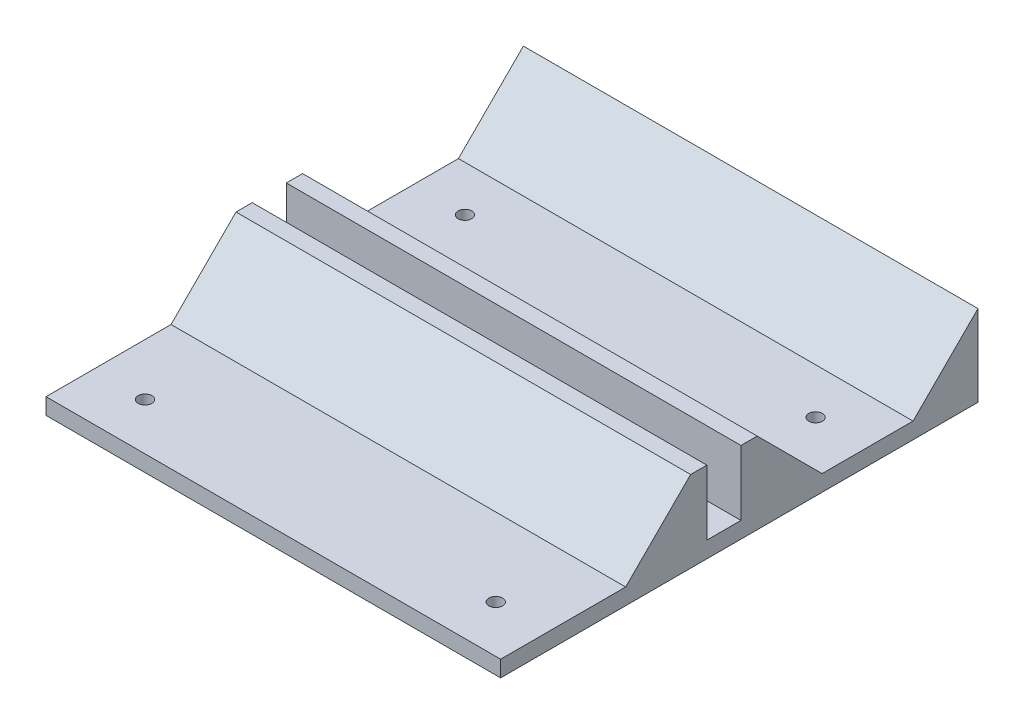
ISO-10303-21;
HEADER;
FILE_DESCRIPTION(('STEP AP214'),'2;1');
FILE_NAME('part.step','',(''),(''),'','','');
FILE_SCHEMA(('AUTOMOTIVE_DESIGN { 1 0 10303 214 1 1 1 1 }'));
ENDSEC;
DATA;
#1=APPLICATION_CONTEXT('core data for automotive mechanical design processes');
#2=APPLICATION_PROTOCOL_DEFINITION('international standard','automotive_design',2000,#1);
#3=PRODUCT_CONTEXT('',#1,'mechanical');
#4=PRODUCT('Part','Part','',(#3));
#5=PRODUCT_RELATED_PRODUCT_CATEGORY('part','',(#4));
#6=PRODUCT_DEFINITION_FORMATION('','',#4);
#7=PRODUCT_DEFINITION_CONTEXT('part definition',#1,'design');
#8=PRODUCT_DEFINITION('design','',#6,#7);
#9=PRODUCT_DEFINITION_SHAPE('','',#8);
#10=(LENGTH_UNIT() NAMED_UNIT(*) SI_UNIT(.MILLI.,.METRE.));
#11=(NAMED_UNIT(*) PLANE_ANGLE_UNIT() SI_UNIT($,.RADIAN.));
#12=(NAMED_UNIT(*) SI_UNIT($,.STERADIAN.) SOLID_ANGLE_UNIT());
#13=UNCERTAINTY_MEASURE_WITH_UNIT(LENGTH_MEASURE(1.E-05),#10,'distance_accuracy_value','');
#14=(GEOMETRIC_REPRESENTATION_CONTEXT(3) GLOBAL_UNCERTAINTY_ASSIGNED_CONTEXT((#13)) GLOBAL_UNIT_ASSIGNED_CONTEXT((#10,
#11,#12)) REPRESENTATION_CONTEXT('',''));
#15=CARTESIAN_POINT('',(0.,0.,0.));
#16=DIRECTION('',(0.,0.,1.));
#17=DIRECTION('',(1.,0.,0.));
#18=AXIS2_PLACEMENT_3D('',#15,#16,#17);
#19=CARTESIAN_POINT('',(10.0000000000001,205.01,150.));
#20=DIRECTION('',(-1.,0.,0.));
#21=DIRECTION('',(0.,0.,1.));
#22=AXIS2_PLACEMENT_3D('',#19,#20,#21);
#23=PLANE('',#22);
#24=DIRECTION('',(0.,0.,1.));
#25=VECTOR('',#24,1.);
#26=CARTESIAN_POINT('',(10.0000000000002,5.,0.));
#27=LINE('',#26,#25);
#28=CARTESIAN_POINT('',(10.0000000000002,5.,-38.4999999999996));
#29=VERTEX_POINT('',#28);
#30=CARTESIAN_POINT('',(10.0000000000002,5.,0.));
#31=VERTEX_POINT('',#30);
#32=EDGE_CURVE('E244',#29,#31,#27,.T.);
#33=ORIENTED_EDGE('',*,*,#32,.F.);
#34=DIRECTION('',(0.,0.707106781186544,-0.707106781186551));
#35=VECTOR('',#34,1.);
#36=CARTESIAN_POINT('',(10.0000000000002,5.,-38.4999999999996));
#37=LINE('',#36,#35);
#38=CARTESIAN_POINT('',(10.0000000000002,25.,-58.4999999999999));
#39=VERTEX_POINT('',#38);
#40=EDGE_CURVE('E216',#29,#39,#37,.T.);
#41=ORIENTED_EDGE('',*,*,#40,.T.);
#42=DIRECTION('',(0.,0.,1.));
#43=VECTOR('',#42,1.);
#44=CARTESIAN_POINT('',(10.0000000000002,25.,0.));
#45=LINE('',#44,#43);
#46=CARTESIAN_POINT('',(10.0000000000002,25.,-63.5));
#47=VERTEX_POINT('',#46);
#48=EDGE_CURVE('E247',#47,#39,#45,.T.);
#49=ORIENTED_EDGE('',*,*,#48,.F.);
#50=DIRECTION('',(0.,1.,0.));
#51=VECTOR('',#50,1.);
#52=CARTESIAN_POINT('',(10.0000000000002,25.,-63.5));
#53=LINE('',#52,#51);
#54=CARTESIAN_POINT('',(10.0000000000002,5.,-63.5));
#55=VERTEX_POINT('',#54);
#56=EDGE_CURVE('E255',#55,#47,#53,.T.);
#57=ORIENTED_EDGE('',*,*,#56,.F.);
#58=DIRECTION('',(0.,0.,1.));
#59=VECTOR('',#58,1.);
#60=CARTESIAN_POINT('',(10.0000000000002,5.,0.));
#61=LINE('',#60,#59);
#62=CARTESIAN_POINT('',(10.0000000000002,5.,-74.));
#63=VERTEX_POINT('',#62);
#64=EDGE_CURVE('E250',#63,#55,#61,.T.);
#65=ORIENTED_EDGE('',*,*,#64,.F.);
#66=DIRECTION('',(0.,1.,0.));
#67=VECTOR('',#66,1.);
#68=CARTESIAN_POINT('',(10.0000000000002,25.,-74.));
#69=LINE('',#68,#67);
#70=CARTESIAN_POINT('',(10.0000000000002,25.,-74.));
#71=VERTEX_POINT('',#70);
#72=EDGE_CURVE('E222',#63,#71,#69,.T.);
#73=ORIENTED_EDGE('',*,*,#72,.T.);
#74=DIRECTION('',(0.,0.,1.));
#75=VECTOR('',#74,1.);
#76=CARTESIAN_POINT('',(10.0000000000002,25.,0.));
#77=LINE('',#76,#75);
#78=CARTESIAN_POINT('',(10.0000000000002,25.,-79.0000000000004));
#79=VERTEX_POINT('',#78);
#80=EDGE_CURVE('E221',#79,#71,#77,.T.);
#81=ORIENTED_EDGE('',*,*,#80,.F.);
#82=DIRECTION('',(0.,0.707106781186551,0.707106781186544));
#83=VECTOR('',#82,1.);
#84=CARTESIAN_POINT('',(10.0000000000002,27.0000000000004,-77.));
#85=LINE('',#84,#83);
#86=CARTESIAN_POINT('',(10.0000000000002,5.,-99.0000000000002));
#87=VERTEX_POINT('',#86);
#88=EDGE_CURVE('E199',#79,#87,#85,.F.);
#89=ORIENTED_EDGE('',*,*,#88,.T.);
#90=DIRECTION('',(0.,0.,1.));
#91=VECTOR('',#90,1.);
#92=CARTESIAN_POINT('',(10.0000000000002,5.,0.));
#93=LINE('',#92,#91);
#94=CARTESIAN_POINT('',(10.0000000000002,5.,-127.));
#95=VERTEX_POINT('',#94);
#96=EDGE_CURVE('E210',#95,#87,#93,.T.);
#97=ORIENTED_EDGE('',*,*,#96,.F.);
#98=DIRECTION('',(0.,-0.707106781186552,0.707106781186543));
#99=VECTOR('',#98,1.);
#100=CARTESIAN_POINT('',(10.0000000000002,5.00000000000017,-127.000000000001));
#101=LINE('',#100,#99);
#102=CARTESIAN_POINT('',(10.0000000000002,25.,-147.));
#103=VERTEX_POINT('',#102);
#104=EDGE_CURVE('E49',#103,#95,#101,.T.);
#105=ORIENTED_EDGE('',*,*,#104,.F.);
#106=DIRECTION('',(0.,-1.,0.));
#107=VECTOR('',#106,1.);
#108=CARTESIAN_POINT('',(10.0000000000002,5.,-147.));
#109=LINE('',#108,#107);
#110=CARTESIAN_POINT('',(10.0000000000002,5.,-147.));
#111=VERTEX_POINT('',#110);
#112=EDGE_CURVE('E236',#103,#111,#109,.T.);
#113=ORIENTED_EDGE('',*,*,#112,.T.);
#114=DIRECTION('',(0.,0.,1.));
#115=VECTOR('',#114,1.);
#116=CARTESIAN_POINT('',(10.0000000000002,5.,0.));
#117=LINE('',#116,#115);
#118=CARTESIAN_POINT('',(10.0000000000002,5.,-150.));
#119=VERTEX_POINT('',#118);
#120=EDGE_CURVE('E215',#119,#111,#117,.T.);
#121=ORIENTED_EDGE('',*,*,#120,.F.);
#122=DIRECTION('',(0.,1.,0.));
#123=VECTOR('',#122,1.);
#124=CARTESIAN_POINT('',(10.0000000000002,5.,-150.));
#125=LINE('',#124,#123);
#126=CARTESIAN_POINT('',(10.0000000000002,0.,-150.));
#127=VERTEX_POINT('',#126);
#128=EDGE_CURVE('E256',#127,#119,#125,.T.);
#129=ORIENTED_EDGE('',*,*,#128,.F.);
#130=DIRECTION('',(0.,0.,1.));
#131=VECTOR('',#130,1.);
#132=CARTESIAN_POINT('',(10.0000000000002,0.,0.));
#133=LINE('',#132,#131);
#134=CARTESIAN_POINT('',(10.0000000000002,0.,0.));
#135=VERTEX_POINT('',#134);
#136=EDGE_CURVE('E225',#127,#135,#133,.T.);
#137=ORIENTED_EDGE('',*,*,#136,.T.);
#138=DIRECTION('',(0.,1.,0.));
#139=VECTOR('',#138,1.);
#140=CARTESIAN_POINT('',(10.0000000000002,205.01,0.));
#141=LINE('',#140,#139);
#142=EDGE_CURVE('E223',#135,#31,#141,.T.);
#143=ORIENTED_EDGE('',*,*,#142,.T.);
#144=EDGE_LOOP('',(#33,#41,#49,#57,#65,#73,#81,#89,#97,#105,#113,#121,#129,#137,#143));
#145=FACE_BOUND('',#144,.T.);
#146=ADVANCED_FACE('F44',(#145),#23,.T.);
#147=CARTESIAN_POINT('',(150.,205.01,0.));
#148=DIRECTION('',(0.,0.,1.));
#149=DIRECTION('',(1.,0.,0.));
#150=AXIS2_PLACEMENT_3D('',#147,#148,#149);
#151=PLANE('',#150);
#152=DIRECTION('',(1.,0.,0.));
#153=VECTOR('',#152,1.);
#154=CARTESIAN_POINT('',(0.,5.,0.));
#155=LINE('',#154,#153);
#156=CARTESIAN_POINT('',(150.,5.,0.));
#157=VERTEX_POINT('',#156);
#158=EDGE_CURVE('E243',#31,#157,#155,.T.);
#159=ORIENTED_EDGE('',*,*,#158,.F.);
#160=ORIENTED_EDGE('',*,*,#142,.F.);
#161=DIRECTION('',(1.,0.,0.));
#162=VECTOR('',#161,1.);
#163=CARTESIAN_POINT('',(0.,0.,0.));
#164=LINE('',#163,#162);
#165=CARTESIAN_POINT('',(150.,0.,0.));
#166=VERTEX_POINT('',#165);
#167=EDGE_CURVE('E235',#135,#166,#164,.T.);
#168=ORIENTED_EDGE('',*,*,#167,.T.);
#169=DIRECTION('',(0.,-1.,0.));
#170=VECTOR('',#169,1.);
#171=CARTESIAN_POINT('',(150.,5.,0.));
#172=LINE('',#171,#170);
#173=EDGE_CURVE('E253',#157,#166,#172,.T.);
#174=ORIENTED_EDGE('',*,*,#173,.F.);
#175=EDGE_LOOP('',(#159,#160,#168,#174));
#176=FACE_BOUND('',#175,.T.);
#177=ADVANCED_FACE('F436',(#176),#151,.T.);
#178=CARTESIAN_POINT('',(0.,5.,0.));
#179=DIRECTION('',(0.,1.,0.));
#180=DIRECTION('',(0.,0.,1.));
#181=AXIS2_PLACEMENT_3D('',#178,#179,#180);
#182=PLANE('',#181);
#183=DIRECTION('',(-1.,0.,0.));
#184=VECTOR('',#183,1.);
#185=CARTESIAN_POINT('',(150.,5.,-147.000000000001));
#186=LINE('',#185,#184);
#187=CARTESIAN_POINT('',(90.,5.,-147.));
#188=VERTEX_POINT('',#187);
#189=CARTESIAN_POINT('',(60.,5.,-147.));
#190=VERTEX_POINT('',#189);
#191=EDGE_CURVE('E394',#188,#190,#186,.T.);
#192=ORIENTED_EDGE('',*,*,#191,.F.);
#193=DIRECTION('',(0.,0.,1.));
#194=VECTOR('',#193,1.);
#195=CARTESIAN_POINT('',(90.,5.,-150.));
#196=LINE('',#195,#194);
#197=CARTESIAN_POINT('',(90.,5.,-150.));
#198=VERTEX_POINT('',#197);
#199=EDGE_CURVE('E327',#198,#188,#196,.T.);
#200=ORIENTED_EDGE('',*,*,#199,.F.);
#201=DIRECTION('',(1.,0.,0.));
#202=VECTOR('',#201,1.);
#203=CARTESIAN_POINT('',(60.,5.,-150.));
#204=LINE('',#203,#202);
#205=CARTESIAN_POINT('',(60.,5.,-150.));
#206=VERTEX_POINT('',#205);
#207=EDGE_CURVE('E338',#206,#198,#204,.T.);
#208=ORIENTED_EDGE('',*,*,#207,.F.);
#209=DIRECTION('',(0.,0.,-1.));
#210=VECTOR('',#209,1.);
#211=CARTESIAN_POINT('',(60.,5.,-147.));
#212=LINE('',#211,#210);
#213=EDGE_CURVE('E322',#190,#206,#212,.T.);
#214=ORIENTED_EDGE('',*,*,#213,.F.);
#215=EDGE_LOOP('',(#192,#200,#208,#214));
#216=FACE_BOUND('',#215,.T.);
#217=ADVANCED_FACE('F464',(#216),#182,.T.);
#218=CARTESIAN_POINT('',(0.,5.,-38.4999999999996));
#219=DIRECTION('',(0.,-0.707106781186551,-0.707106781186544));
#220=DIRECTION('',(-1.,0.,0.));
#221=AXIS2_PLACEMENT_3D('',#218,#219,#220);
#222=PLANE('',#221);
#223=ORIENTED_EDGE('',*,*,#40,.F.);
#224=DIRECTION('',(-1.,0.,0.));
#225=VECTOR('',#224,1.);
#226=CARTESIAN_POINT('',(0.,5.,-38.4999999999996));
#227=LINE('',#226,#225);
#228=CARTESIAN_POINT('',(150.,5.,-38.4999999999996));
#229=VERTEX_POINT('',#228);
#230=EDGE_CURVE('E205',#229,#29,#227,.T.);
#231=ORIENTED_EDGE('',*,*,#230,.F.);
#232=DIRECTION('',(0.,-0.707106781186544,0.707106781186551));
#233=VECTOR('',#232,1.);
#234=CARTESIAN_POINT('',(150.,5.,-38.4999999999996));
#235=LINE('',#234,#233);
#236=CARTESIAN_POINT('',(150.,25.,-58.4999999999999));
#237=VERTEX_POINT('',#236);
#238=EDGE_CURVE('E267',#237,#229,#235,.T.);
#239=ORIENTED_EDGE('',*,*,#238,.F.);
#240=DIRECTION('',(1.,0.,0.));
#241=VECTOR('',#240,1.);
#242=CARTESIAN_POINT('',(0.,25.,-58.4999999999999));
#243=LINE('',#242,#241);
#244=EDGE_CURVE('E206',#39,#237,#243,.T.);
#245=ORIENTED_EDGE('',*,*,#244,.F.);
#246=EDGE_LOOP('',(#223,#231,#239,#245));
#247=FACE_BOUND('',#246,.T.);
#248=ADVANCED_FACE('F430',(#247),#222,.F.);
#249=CARTESIAN_POINT('',(134.,5.,-14.4999999999997));
#250=DIRECTION('',(0.,1.,0.));
#251=DIRECTION('',(0.,0.,1.));
#252=AXIS2_PLACEMENT_3D('',#249,#250,#251);
#253=CIRCLE('',#252,2.09999999999999);
#254=CARTESIAN_POINT('',(134.,5.,-12.3999999999997));
#255=VERTEX_POINT('',#254);
#256=EDGE_CURVE('E11',#255,#255,#253,.T.);
#257=ORIENTED_EDGE('',*,*,#256,.F.);
#258=EDGE_LOOP('',(#257));
#259=FACE_BOUND('',#258,.T.);
#260=CARTESIAN_POINT('',(26.0000000000002,5.,-14.4999999999997));
#261=DIRECTION('',(0.,1.,0.));
#262=DIRECTION('',(0.,0.,1.));
#263=AXIS2_PLACEMENT_3D('',#260,#261,#262);
#264=CIRCLE('',#263,2.1);
#265=CARTESIAN_POINT('',(26.0000000000002,5.,-12.3999999999997));
#266=VERTEX_POINT('',#265);
#267=EDGE_CURVE('E365',#266,#266,#264,.T.);
#268=ORIENTED_EDGE('',*,*,#267,.F.);
#269=EDGE_LOOP('',(#268));
#270=FACE_BOUND('',#269,.T.);
#271=ORIENTED_EDGE('',*,*,#32,.T.);
#272=ORIENTED_EDGE('',*,*,#158,.T.);
#273=DIRECTION('',(0.,0.,1.));
#274=VECTOR('',#273,1.);
#275=CARTESIAN_POINT('',(150.,5.,0.));
#276=LINE('',#275,#274);
#277=EDGE_CURVE('E384',#229,#157,#276,.T.);
#278=ORIENTED_EDGE('',*,*,#277,.F.);
#279=ORIENTED_EDGE('',*,*,#230,.T.);
#280=EDGE_LOOP('',(#271,#272,#278,#279));
#281=FACE_BOUND('',#280,.T.);
#282=ADVANCED_FACE('F432',(#259,#270,#281),#182,.T.);
#283=CARTESIAN_POINT('',(90.,5.,-150.));
#284=DIRECTION('',(1.,0.,0.));
#285=DIRECTION('',(0.,0.,-1.));
#286=AXIS2_PLACEMENT_3D('',#283,#284,#285);
#287=PLANE('',#286);
#288=DIRECTION('',(0.,0.,1.));
#289=VECTOR('',#288,1.);
#290=CARTESIAN_POINT('',(90.,0.,-150.));
#291=LINE('',#290,#289);
#292=CARTESIAN_POINT('',(90.,0.,-150.));
#293=VERTEX_POINT('',#292);
#294=CARTESIAN_POINT('',(90.,0.,-147.));
#295=VERTEX_POINT('',#294);
#296=EDGE_CURVE('E331',#293,#295,#291,.T.);
#297=ORIENTED_EDGE('',*,*,#296,.F.);
#298=DIRECTION('',(0.,-1.,0.));
#299=VECTOR('',#298,1.);
#300=CARTESIAN_POINT('',(90.,5.,-150.));
#301=LINE('',#300,#299);
#302=EDGE_CURVE('E72',#198,#293,#301,.T.);
#303=ORIENTED_EDGE('',*,*,#302,.F.);
#304=ORIENTED_EDGE('',*,*,#199,.T.);
#305=DIRECTION('',(0.,-1.,0.));
#306=VECTOR('',#305,1.);
#307=CARTESIAN_POINT('',(90.,5.,-147.));
#308=LINE('',#307,#306);
#309=EDGE_CURVE('E305',#188,#295,#308,.T.);
#310=ORIENTED_EDGE('',*,*,#309,.T.);
#311=EDGE_LOOP('',(#297,#303,#304,#310));
#312=FACE_BOUND('',#311,.T.);
#313=ADVANCED_FACE('F504',(#312),#287,.T.);
#314=CARTESIAN_POINT('',(60.,5.,-150.));
#315=DIRECTION('',(0.,0.,-1.));
#316=DIRECTION('',(-1.,0.,0.));
#317=AXIS2_PLACEMENT_3D('',#314,#315,#316);
#318=PLANE('',#317);
#319=DIRECTION('',(1.,0.,0.));
#320=VECTOR('',#319,1.);
#321=CARTESIAN_POINT('',(60.,0.,-150.));
#322=LINE('',#321,#320);
#323=CARTESIAN_POINT('',(60.,0.,-150.));
#324=VERTEX_POINT('',#323);
#325=EDGE_CURVE('E326',#324,#293,#322,.T.);
#326=ORIENTED_EDGE('',*,*,#325,.F.);
#327=DIRECTION('',(0.,-1.,0.));
#328=VECTOR('',#327,1.);
#329=CARTESIAN_POINT('',(60.,5.,-150.));
#330=LINE('',#329,#328);
#331=EDGE_CURVE('E316',#206,#324,#330,.T.);
#332=ORIENTED_EDGE('',*,*,#331,.F.);
#333=ORIENTED_EDGE('',*,*,#207,.T.);
#334=ORIENTED_EDGE('',*,*,#302,.T.);
#335=EDGE_LOOP('',(#326,#332,#333,#334));
#336=FACE_BOUND('',#335,.T.);
#337=ADVANCED_FACE('F509',(#336),#318,.T.);
#338=CARTESIAN_POINT('',(60.,5.,-147.));
#339=DIRECTION('',(-1.,0.,0.));
#340=DIRECTION('',(0.,0.,1.));
#341=AXIS2_PLACEMENT_3D('',#338,#339,#340);
#342=PLANE('',#341);
#343=DIRECTION('',(0.,0.,-1.));
#344=VECTOR('',#343,1.);
#345=CARTESIAN_POINT('',(60.,0.,-147.));
#346=LINE('',#345,#344);
#347=CARTESIAN_POINT('',(60.,0.,-147.));
#348=VERTEX_POINT('',#347);
#349=EDGE_CURVE('E323',#348,#324,#346,.T.);
#350=ORIENTED_EDGE('',*,*,#349,.F.);
#351=DIRECTION('',(0.,-1.,0.));
#352=VECTOR('',#351,1.);
#353=CARTESIAN_POINT('',(60.,5.,-147.));
#354=LINE('',#353,#352);
#355=EDGE_CURVE('E319',#190,#348,#354,.T.);
#356=ORIENTED_EDGE('',*,*,#355,.F.);
#357=ORIENTED_EDGE('',*,*,#213,.T.);
#358=ORIENTED_EDGE('',*,*,#331,.T.);
#359=EDGE_LOOP('',(#350,#356,#357,#358));
#360=FACE_BOUND('',#359,.T.);
#361=ADVANCED_FACE('F549',(#360),#342,.T.);
#362=CARTESIAN_POINT('',(0.,25.,-74.));
#363=DIRECTION('',(0.,0.,-1.));
#364=DIRECTION('',(-1.,0.,0.));
#365=AXIS2_PLACEMENT_3D('',#362,#363,#364);
#366=PLANE('',#365);
#367=ORIENTED_EDGE('',*,*,#72,.F.);
#368=DIRECTION('',(-1.,0.,0.));
#369=VECTOR('',#368,1.);
#370=CARTESIAN_POINT('',(0.,5.,-74.));
#371=LINE('',#370,#369);
#372=CARTESIAN_POINT('',(150.,5.,-74.));
#373=VERTEX_POINT('',#372);
#374=EDGE_CURVE('E279',#373,#63,#371,.T.);
#375=ORIENTED_EDGE('',*,*,#374,.F.);
#376=DIRECTION('',(0.,-1.,0.));
#377=VECTOR('',#376,1.);
#378=CARTESIAN_POINT('',(150.,25.,-74.));
#379=LINE('',#378,#377);
#380=CARTESIAN_POINT('',(150.,25.,-74.));
#381=VERTEX_POINT('',#380);
#382=EDGE_CURVE('E274',#381,#373,#379,.T.);
#383=ORIENTED_EDGE('',*,*,#382,.F.);
#384=DIRECTION('',(1.,0.,0.));
#385=VECTOR('',#384,1.);
#386=CARTESIAN_POINT('',(0.,25.,-74.));
#387=LINE('',#386,#385);
#388=EDGE_CURVE('E282',#71,#381,#387,.T.);
#389=ORIENTED_EDGE('',*,*,#388,.F.);
#390=EDGE_LOOP('',(#367,#375,#383,#389));
#391=FACE_BOUND('',#390,.T.);
#392=ADVANCED_FACE('F450',(#391),#366,.F.);
#393=CARTESIAN_POINT('',(150.,5.,0.));
#394=DIRECTION('',(1.,0.,0.));
#395=DIRECTION('',(0.,0.,-1.));
#396=AXIS2_PLACEMENT_3D('',#393,#394,#395);
#397=PLANE('',#396);
#398=ORIENTED_EDGE('',*,*,#277,.T.);
#399=ORIENTED_EDGE('',*,*,#173,.T.);
#400=DIRECTION('',(0.,0.,1.));
#401=VECTOR('',#400,1.);
#402=CARTESIAN_POINT('',(150.,0.,0.));
#403=LINE('',#402,#401);
#404=CARTESIAN_POINT('',(150.,0.,-147.));
#405=VERTEX_POINT('',#404);
#406=EDGE_CURVE('E385',#405,#166,#403,.T.);
#407=ORIENTED_EDGE('',*,*,#406,.F.);
#408=DIRECTION('',(0.,-1.,0.));
#409=VECTOR('',#408,1.);
#410=CARTESIAN_POINT('',(150.,5.,-147.));
#411=LINE('',#410,#409);
#412=CARTESIAN_POINT('',(150.,25.,-147.000000000001));
#413=VERTEX_POINT('',#412);
#414=EDGE_CURVE('E63',#413,#405,#411,.T.);
#415=ORIENTED_EDGE('',*,*,#414,.F.);
#416=DIRECTION('',(0.,0.707106781186552,-0.707106781186543));
#417=VECTOR('',#416,1.);
#418=CARTESIAN_POINT('',(150.,5.,-127.000000000001));
#419=LINE('',#418,#417);
#420=CARTESIAN_POINT('',(150.,5.,-127.000000000001));
#421=VERTEX_POINT('',#420);
#422=EDGE_CURVE('E343',#421,#413,#419,.T.);
#423=ORIENTED_EDGE('',*,*,#422,.F.);
#424=CARTESIAN_POINT('',(150.,5.,-99.0000000000002));
#425=VERTEX_POINT('',#424);
#426=EDGE_CURVE('E273',#421,#425,#276,.T.);
#427=ORIENTED_EDGE('',*,*,#426,.T.);
#428=DIRECTION('',(0.,-0.707106781186551,-0.707106781186544));
#429=VECTOR('',#428,1.);
#430=CARTESIAN_POINT('',(150.,27.0000000000004,-77.));
#431=LINE('',#430,#429);
#432=CARTESIAN_POINT('',(150.,25.,-79.0000000000004));
#433=VERTEX_POINT('',#432);
#434=EDGE_CURVE('E201',#425,#433,#431,.F.);
#435=ORIENTED_EDGE('',*,*,#434,.T.);
#436=DIRECTION('',(0.,0.,1.));
#437=VECTOR('',#436,1.);
#438=CARTESIAN_POINT('',(150.,25.,0.));
#439=LINE('',#438,#437);
#440=EDGE_CURVE('E278',#433,#381,#439,.T.);
#441=ORIENTED_EDGE('',*,*,#440,.T.);
#442=ORIENTED_EDGE('',*,*,#382,.T.);
#443=CARTESIAN_POINT('',(150.,5.,-63.5));
#444=VERTEX_POINT('',#443);
#445=EDGE_CURVE('E383',#373,#444,#276,.T.);
#446=ORIENTED_EDGE('',*,*,#445,.T.);
#447=DIRECTION('',(0.,-1.,0.));
#448=VECTOR('',#447,1.);
#449=CARTESIAN_POINT('',(150.,25.,-63.5));
#450=LINE('',#449,#448);
#451=CARTESIAN_POINT('',(150.,25.,-63.5));
#452=VERTEX_POINT('',#451);
#453=EDGE_CURVE('E283',#452,#444,#450,.T.);
#454=ORIENTED_EDGE('',*,*,#453,.F.);
#455=DIRECTION('',(0.,0.,1.));
#456=VECTOR('',#455,1.);
#457=CARTESIAN_POINT('',(150.,25.,0.));
#458=LINE('',#457,#456);
#459=EDGE_CURVE('E289',#452,#237,#458,.T.);
#460=ORIENTED_EDGE('',*,*,#459,.T.);
#461=ORIENTED_EDGE('',*,*,#238,.T.);
#462=EDGE_LOOP('',(#398,#399,#407,#415,#423,#427,#435,#441,#442,#446,#454,#460,#461));
#463=FACE_BOUND('',#462,.T.);
#464=ADVANCED_FACE('F426',(#463),#397,.T.);
#465=CARTESIAN_POINT('',(26.0000000000001,5.,-113.));
#466=DIRECTION('',(0.,1.,0.));
#467=DIRECTION('',(0.,0.,1.));
#468=AXIS2_PLACEMENT_3D('',#465,#466,#467);
#469=CIRCLE('',#468,2.1);
#470=CARTESIAN_POINT('',(26.0000000000001,5.,-110.9));
#471=VERTEX_POINT('',#470);
#472=EDGE_CURVE('E349',#471,#471,#469,.T.);
#473=ORIENTED_EDGE('',*,*,#472,.F.);
#474=EDGE_LOOP('',(#473));
#475=FACE_BOUND('',#474,.T.);
#476=CARTESIAN_POINT('',(134.,5.,-113.));
#477=DIRECTION('',(0.,1.,0.));
#478=DIRECTION('',(0.,0.,1.));
#479=AXIS2_PLACEMENT_3D('',#476,#477,#478);
#480=CIRCLE('',#479,2.09999999999999);
#481=CARTESIAN_POINT('',(134.,5.,-110.9));
#482=VERTEX_POINT('',#481);
#483=EDGE_CURVE('E357',#482,#482,#480,.T.);
#484=ORIENTED_EDGE('',*,*,#483,.F.);
#485=EDGE_LOOP('',(#484));
#486=FACE_BOUND('',#485,.T.);
#487=DIRECTION('',(-1.,0.,0.));
#488=VECTOR('',#487,1.);
#489=CARTESIAN_POINT('',(150.,5.,-127.000000000001));
#490=LINE('',#489,#488);
#491=EDGE_CURVE('E213',#421,#95,#490,.T.);
#492=ORIENTED_EDGE('',*,*,#491,.T.);
#493=ORIENTED_EDGE('',*,*,#96,.T.);
#494=DIRECTION('',(1.,0.,0.));
#495=VECTOR('',#494,1.);
#496=CARTESIAN_POINT('',(150.,5.,-99.0000000000002));
#497=LINE('',#496,#495);
#498=EDGE_CURVE('E195',#87,#425,#497,.T.);
#499=ORIENTED_EDGE('',*,*,#498,.T.);
#500=ORIENTED_EDGE('',*,*,#426,.F.);
#501=EDGE_LOOP('',(#492,#493,#499,#500));
#502=FACE_BOUND('',#501,.T.);
#503=ADVANCED_FACE('F211',(#475,#486,#502),#182,.T.);
#504=CARTESIAN_POINT('',(0.,5.,-147.));
#505=DIRECTION('',(0.,0.,1.));
#506=DIRECTION('',(1.,0.,0.));
#507=AXIS2_PLACEMENT_3D('',#504,#505,#506);
#508=PLANE('',#507);
#509=ORIENTED_EDGE('',*,*,#112,.F.);
#510=DIRECTION('',(-1.,0.,0.));
#511=VECTOR('',#510,1.);
#512=CARTESIAN_POINT('',(150.,25.,-147.000000000001));
#513=LINE('',#512,#511);
#514=EDGE_CURVE('E348',#413,#103,#513,.T.);
#515=ORIENTED_EDGE('',*,*,#514,.F.);
#516=ORIENTED_EDGE('',*,*,#414,.T.);
#517=DIRECTION('',(-1.,0.,0.));
#518=VECTOR('',#517,1.);
#519=CARTESIAN_POINT('',(0.,0.,-147.));
#520=LINE('',#519,#518);
#521=EDGE_CURVE('E387',#405,#295,#520,.T.);
#522=ORIENTED_EDGE('',*,*,#521,.T.);
#523=ORIENTED_EDGE('',*,*,#309,.F.);
#524=ORIENTED_EDGE('',*,*,#191,.T.);
#525=ORIENTED_EDGE('',*,*,#355,.T.);
#526=CARTESIAN_POINT('',(30.,0.,-147.));
#527=VERTEX_POINT('',#526);
#528=EDGE_CURVE('E91',#348,#527,#520,.T.);
#529=ORIENTED_EDGE('',*,*,#528,.T.);
#530=DIRECTION('',(0.,-1.,0.));
#531=VECTOR('',#530,1.);
#532=CARTESIAN_POINT('',(30.,5.,-147.));
#533=LINE('',#532,#531);
#534=CARTESIAN_POINT('',(30.,5.,-147.));
#535=VERTEX_POINT('',#534);
#536=EDGE_CURVE('E293',#535,#527,#533,.T.);
#537=ORIENTED_EDGE('',*,*,#536,.F.);
#538=EDGE_CURVE('E391',#535,#111,#186,.T.);
#539=ORIENTED_EDGE('',*,*,#538,.T.);
#540=EDGE_LOOP('',(#509,#515,#516,#522,#523,#524,#525,#529,#537,#539));
#541=FACE_BOUND('',#540,.T.);
#542=ADVANCED_FACE('F461',(#541),#508,.F.);
#543=CARTESIAN_POINT('',(150.,5.,-127.000000000001));
#544=DIRECTION('',(0.,0.707106781186543,0.707106781186552));
#545=DIRECTION('',(0.,-0.707106781186552,0.707106781186543));
#546=AXIS2_PLACEMENT_3D('',#543,#544,#545);
#547=PLANE('',#546);
#548=ORIENTED_EDGE('',*,*,#514,.T.);
#549=ORIENTED_EDGE('',*,*,#104,.T.);
#550=ORIENTED_EDGE('',*,*,#491,.F.);
#551=ORIENTED_EDGE('',*,*,#422,.T.);
#552=EDGE_LOOP('',(#548,#549,#550,#551));
#553=FACE_BOUND('',#552,.T.);
#554=ADVANCED_FACE('F455',(#553),#547,.T.);
#555=CARTESIAN_POINT('',(0.,25.,0.));
#556=DIRECTION('',(0.,1.,0.));
#557=DIRECTION('',(0.,0.,1.));
#558=AXIS2_PLACEMENT_3D('',#555,#556,#557);
#559=PLANE('',#558);
#560=DIRECTION('',(1.,0.,0.));
#561=VECTOR('',#560,1.);
#562=CARTESIAN_POINT('',(0.,25.,-79.0000000000004));
#563=LINE('',#562,#561);
#564=EDGE_CURVE('E230',#433,#79,#563,.F.);
#565=ORIENTED_EDGE('',*,*,#564,.T.);
#566=ORIENTED_EDGE('',*,*,#80,.T.);
#567=ORIENTED_EDGE('',*,*,#388,.T.);
#568=ORIENTED_EDGE('',*,*,#440,.F.);
#569=EDGE_LOOP('',(#565,#566,#567,#568));
#570=FACE_BOUND('',#569,.T.);
#571=ADVANCED_FACE('F453',(#570),#559,.T.);
#572=CARTESIAN_POINT('',(0.,27.0000000000004,-77.));
#573=DIRECTION('',(0.,0.707106781186544,-0.707106781186551));
#574=DIRECTION('',(1.,0.,0.));
#575=AXIS2_PLACEMENT_3D('',#572,#573,#574);
#576=PLANE('',#575);
#577=ORIENTED_EDGE('',*,*,#88,.F.);
#578=ORIENTED_EDGE('',*,*,#564,.F.);
#579=ORIENTED_EDGE('',*,*,#434,.F.);
#580=ORIENTED_EDGE('',*,*,#498,.F.);
#581=EDGE_LOOP('',(#577,#578,#579,#580));
#582=FACE_BOUND('',#581,.T.);
#583=ADVANCED_FACE('F47',(#582),#576,.T.);
#584=CARTESIAN_POINT('',(0.,25.,0.));
#585=DIRECTION('',(0.,1.,0.));
#586=DIRECTION('',(0.,0.,1.));
#587=AXIS2_PLACEMENT_3D('',#584,#585,#586);
#588=PLANE('',#587);
#589=DIRECTION('',(1.,0.,0.));
#590=VECTOR('',#589,1.);
#591=CARTESIAN_POINT('',(0.,25.,-63.5));
#592=LINE('',#591,#590);
#593=EDGE_CURVE('E287',#47,#452,#592,.T.);
#594=ORIENTED_EDGE('',*,*,#593,.F.);
#595=ORIENTED_EDGE('',*,*,#48,.T.);
#596=ORIENTED_EDGE('',*,*,#244,.T.);
#597=ORIENTED_EDGE('',*,*,#459,.F.);
#598=EDGE_LOOP('',(#594,#595,#596,#597));
#599=FACE_BOUND('',#598,.T.);
#600=ADVANCED_FACE('F419',(#599),#588,.T.);
#601=ORIENTED_EDGE('',*,*,#374,.T.);
#602=ORIENTED_EDGE('',*,*,#64,.T.);
#603=DIRECTION('',(-1.,0.,0.));
#604=VECTOR('',#603,1.);
#605=CARTESIAN_POINT('',(0.,5.,-63.5));
#606=LINE('',#605,#604);
#607=EDGE_CURVE('E288',#444,#55,#606,.T.);
#608=ORIENTED_EDGE('',*,*,#607,.F.);
#609=ORIENTED_EDGE('',*,*,#445,.F.);
#610=EDGE_LOOP('',(#601,#602,#608,#609));
#611=FACE_BOUND('',#610,.T.);
#612=ADVANCED_FACE('F448',(#611),#182,.T.);
#613=CARTESIAN_POINT('',(0.,25.,-63.5));
#614=DIRECTION('',(0.,0.,-1.));
#615=DIRECTION('',(-1.,0.,0.));
#616=AXIS2_PLACEMENT_3D('',#613,#614,#615);
#617=PLANE('',#616);
#618=ORIENTED_EDGE('',*,*,#607,.T.);
#619=ORIENTED_EDGE('',*,*,#56,.T.);
#620=ORIENTED_EDGE('',*,*,#593,.T.);
#621=ORIENTED_EDGE('',*,*,#453,.T.);
#622=EDGE_LOOP('',(#618,#619,#620,#621));
#623=FACE_BOUND('',#622,.T.);
#624=ADVANCED_FACE('F445',(#623),#617,.T.);
#625=CARTESIAN_POINT('',(134.,0.,-113.));
#626=DIRECTION('',(0.,1.,0.));
#627=DIRECTION('',(0.,0.,1.));
#628=AXIS2_PLACEMENT_3D('',#625,#626,#627);
#629=CYLINDRICAL_SURFACE('',#628,2.09999999999999);
#630=CARTESIAN_POINT('',(134.,0.,-113.));
#631=DIRECTION('',(0.,1.,0.));
#632=DIRECTION('',(0.,0.,1.));
#633=AXIS2_PLACEMENT_3D('',#630,#631,#632);
#634=CIRCLE('',#633,2.09999999999999);
#635=CARTESIAN_POINT('',(134.,0.,-110.9));
#636=VERTEX_POINT('',#635);
#637=EDGE_CURVE('E353',#636,#636,#634,.T.);
#638=ORIENTED_EDGE('',*,*,#637,.F.);
#639=EDGE_LOOP('',(#638));
#640=FACE_BOUND('',#639,.T.);
#641=ORIENTED_EDGE('',*,*,#483,.T.);
#642=EDGE_LOOP('',(#641));
#643=FACE_BOUND('',#642,.T.);
#644=ADVANCED_FACE('F518',(#640,#643),#629,.F.);
#645=CARTESIAN_POINT('',(26.0000000000002,0.,-14.4999999999997));
#646=DIRECTION('',(0.,1.,0.));
#647=DIRECTION('',(0.,0.,1.));
#648=AXIS2_PLACEMENT_3D('',#645,#646,#647);
#649=CYLINDRICAL_SURFACE('',#648,2.1);
#650=CARTESIAN_POINT('',(26.0000000000002,0.,-14.4999999999997));
#651=DIRECTION('',(0.,1.,0.));
#652=DIRECTION('',(0.,0.,1.));
#653=AXIS2_PLACEMENT_3D('',#650,#651,#652);
#654=CIRCLE('',#653,2.1);
#655=CARTESIAN_POINT('',(26.0000000000002,0.,-12.3999999999997));
#656=VERTEX_POINT('',#655);
#657=EDGE_CURVE('E361',#656,#656,#654,.T.);
#658=ORIENTED_EDGE('',*,*,#657,.F.);
#659=EDGE_LOOP('',(#658));
#660=FACE_BOUND('',#659,.T.);
#661=ORIENTED_EDGE('',*,*,#267,.T.);
#662=EDGE_LOOP('',(#661));
#663=FACE_BOUND('',#662,.T.);
#664=ADVANCED_FACE('F515',(#660,#663),#649,.F.);
#665=CARTESIAN_POINT('',(26.0000000000001,0.,-113.));
#666=DIRECTION('',(0.,1.,0.));
#667=DIRECTION('',(0.,0.,1.));
#668=AXIS2_PLACEMENT_3D('',#665,#666,#667);
#669=CYLINDRICAL_SURFACE('',#668,2.1);
#670=CARTESIAN_POINT('',(26.0000000000001,0.,-113.));
#671=DIRECTION('',(0.,1.,0.));
#672=DIRECTION('',(0.,0.,1.));
#673=AXIS2_PLACEMENT_3D('',#670,#671,#672);
#674=CIRCLE('',#673,2.1);
#675=CARTESIAN_POINT('',(26.0000000000001,0.,-110.9));
#676=VERTEX_POINT('',#675);
#677=EDGE_CURVE('E347',#676,#676,#674,.T.);
#678=ORIENTED_EDGE('',*,*,#677,.F.);
#679=EDGE_LOOP('',(#678));
#680=FACE_BOUND('',#679,.T.);
#681=ORIENTED_EDGE('',*,*,#472,.T.);
#682=EDGE_LOOP('',(#681));
#683=FACE_BOUND('',#682,.T.);
#684=ADVANCED_FACE('F517',(#680,#683),#669,.F.);
#685=CARTESIAN_POINT('',(134.,0.,-14.4999999999997));
#686=DIRECTION('',(0.,1.,0.));
#687=DIRECTION('',(0.,0.,1.));
#688=AXIS2_PLACEMENT_3D('',#685,#686,#687);
#689=CYLINDRICAL_SURFACE('',#688,2.09999999999999);
#690=CARTESIAN_POINT('',(134.,0.,-14.4999999999997));
#691=DIRECTION('',(0.,1.,0.));
#692=DIRECTION('',(0.,0.,1.));
#693=AXIS2_PLACEMENT_3D('',#690,#691,#692);
#694=CIRCLE('',#693,2.09999999999999);
#695=CARTESIAN_POINT('',(134.,0.,-12.3999999999997));
#696=VERTEX_POINT('',#695);
#697=EDGE_CURVE('E55',#696,#696,#694,.T.);
#698=ORIENTED_EDGE('',*,*,#697,.F.);
#699=EDGE_LOOP('',(#698));
#700=FACE_BOUND('',#699,.T.);
#701=ORIENTED_EDGE('',*,*,#256,.T.);
#702=EDGE_LOOP('',(#701));
#703=FACE_BOUND('',#702,.T.);
#704=ADVANCED_FACE('F499',(#700,#703),#689,.F.);
#705=CARTESIAN_POINT('',(30.,5.,-150.));
#706=DIRECTION('',(1.,0.,0.));
#707=DIRECTION('',(0.,0.,-1.));
#708=AXIS2_PLACEMENT_3D('',#705,#706,#707);
#709=PLANE('',#708);
#710=DIRECTION('',(0.,0.,1.));
#711=VECTOR('',#710,1.);
#712=CARTESIAN_POINT('',(30.,0.,-150.));
#713=LINE('',#712,#711);
#714=CARTESIAN_POINT('',(30.,0.,-150.));
#715=VERTEX_POINT('',#714);
#716=EDGE_CURVE('E302',#715,#527,#713,.T.);
#717=ORIENTED_EDGE('',*,*,#716,.F.);
#718=DIRECTION('',(0.,-1.,0.));
#719=VECTOR('',#718,1.);
#720=CARTESIAN_POINT('',(30.,5.,-150.));
#721=LINE('',#720,#719);
#722=CARTESIAN_POINT('',(30.,5.,-150.));
#723=VERTEX_POINT('',#722);
#724=EDGE_CURVE('E297',#723,#715,#721,.T.);
#725=ORIENTED_EDGE('',*,*,#724,.F.);
#726=DIRECTION('',(0.,0.,1.));
#727=VECTOR('',#726,1.);
#728=CARTESIAN_POINT('',(30.,5.,-150.));
#729=LINE('',#728,#727);
#730=EDGE_CURVE('E307',#723,#535,#729,.T.);
#731=ORIENTED_EDGE('',*,*,#730,.T.);
#732=ORIENTED_EDGE('',*,*,#536,.T.);
#733=EDGE_LOOP('',(#717,#725,#731,#732));
#734=FACE_BOUND('',#733,.T.);
#735=ADVANCED_FACE('F490',(#734),#709,.T.);
#736=DIRECTION('',(1.,0.,0.));
#737=VECTOR('',#736,1.);
#738=CARTESIAN_POINT('',(0.,5.,-150.));
#739=LINE('',#738,#737);
#740=EDGE_CURVE('E301',#119,#723,#739,.T.);
#741=ORIENTED_EDGE('',*,*,#740,.F.);
#742=ORIENTED_EDGE('',*,*,#120,.T.);
#743=ORIENTED_EDGE('',*,*,#538,.F.);
#744=ORIENTED_EDGE('',*,*,#730,.F.);
#745=EDGE_LOOP('',(#741,#742,#743,#744));
#746=FACE_BOUND('',#745,.T.);
#747=ADVANCED_FACE('F479',(#746),#182,.T.);
#748=CARTESIAN_POINT('',(0.,0.,0.));
#749=DIRECTION('',(0.,1.,0.));
#750=DIRECTION('',(0.,0.,1.));
#751=AXIS2_PLACEMENT_3D('',#748,#749,#750);
#752=PLANE('',#751);
#753=ORIENTED_EDGE('',*,*,#697,.T.);
#754=EDGE_LOOP('',(#753));
#755=FACE_BOUND('',#754,.T.);
#756=ORIENTED_EDGE('',*,*,#677,.T.);
#757=EDGE_LOOP('',(#756));
#758=FACE_BOUND('',#757,.T.);
#759=ORIENTED_EDGE('',*,*,#657,.T.);
#760=EDGE_LOOP('',(#759));
#761=FACE_BOUND('',#760,.T.);
#762=ORIENTED_EDGE('',*,*,#637,.T.);
#763=EDGE_LOOP('',(#762));
#764=FACE_BOUND('',#763,.T.);
#765=ORIENTED_EDGE('',*,*,#167,.F.);
#766=ORIENTED_EDGE('',*,*,#136,.F.);
#767=DIRECTION('',(1.,0.,0.));
#768=VECTOR('',#767,1.);
#769=CARTESIAN_POINT('',(0.,0.,-150.));
#770=LINE('',#769,#768);
#771=EDGE_CURVE('E306',#127,#715,#770,.T.);
#772=ORIENTED_EDGE('',*,*,#771,.T.);
#773=ORIENTED_EDGE('',*,*,#716,.T.);
#774=ORIENTED_EDGE('',*,*,#528,.F.);
#775=ORIENTED_EDGE('',*,*,#349,.T.);
#776=ORIENTED_EDGE('',*,*,#325,.T.);
#777=ORIENTED_EDGE('',*,*,#296,.T.);
#778=ORIENTED_EDGE('',*,*,#521,.F.);
#779=ORIENTED_EDGE('',*,*,#406,.T.);
#780=EDGE_LOOP('',(#765,#766,#772,#773,#774,#775,#776,#777,#778,#779));
#781=FACE_BOUND('',#780,.T.);
#782=ADVANCED_FACE('F489',(#755,#758,#761,#764,#781),#752,.F.);
#783=CARTESIAN_POINT('',(0.,5.,-150.));
#784=DIRECTION('',(0.,0.,-1.));
#785=DIRECTION('',(-1.,0.,0.));
#786=AXIS2_PLACEMENT_3D('',#783,#784,#785);
#787=PLANE('',#786);
#788=ORIENTED_EDGE('',*,*,#771,.F.);
#789=ORIENTED_EDGE('',*,*,#128,.T.);
#790=ORIENTED_EDGE('',*,*,#740,.T.);
#791=ORIENTED_EDGE('',*,*,#724,.T.);
#792=EDGE_LOOP('',(#788,#789,#790,#791));
#793=FACE_BOUND('',#792,.T.);
#794=ADVANCED_FACE('F496',(#793),#787,.T.);
#795=CLOSED_SHELL('',(#146,#177,#217,#248,#282,#313,#337,#361,#392,#464,#503,#542,#554,#571,
#583,#600,#612,#624,#644,#664,#684,#704,#735,#747,#782,#794));
#796=MANIFOLD_SOLID_BREP('B2',#795);
#797=ADVANCED_BREP_SHAPE_REPRESENTATION('',(#18,#796),#14);
#798=SHAPE_DEFINITION_REPRESENTATION(#9,#797);
ENDSEC;
END-ISO-10303-21;
